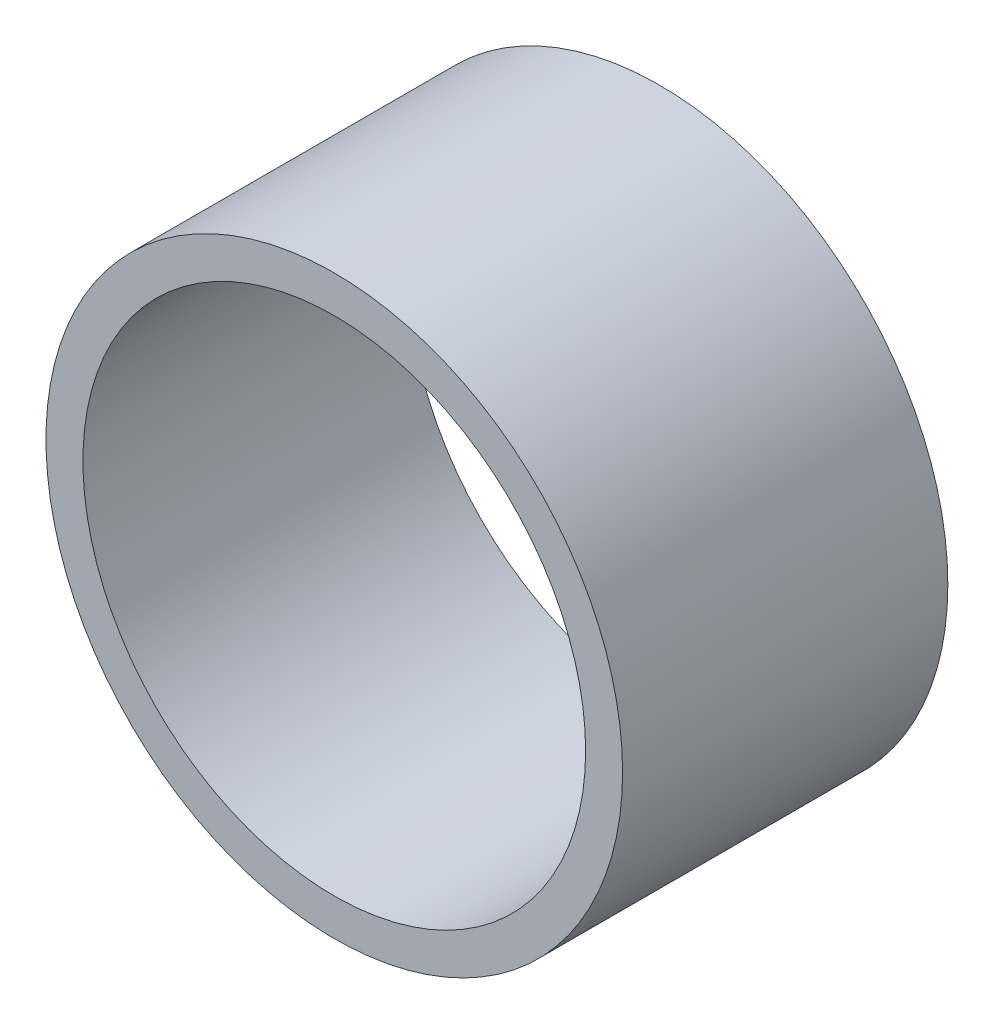
ISO-10303-21;
HEADER;
FILE_DESCRIPTION(('STEP AP214'),'2;1');
FILE_NAME('part.step','',(''),(''),'','','');
FILE_SCHEMA(('AUTOMOTIVE_DESIGN { 1 0 10303 214 1 1 1 1 }'));
ENDSEC;
DATA;
#1=APPLICATION_CONTEXT('core data for automotive mechanical design processes');
#2=APPLICATION_PROTOCOL_DEFINITION('international standard','automotive_design',2000,#1);
#3=PRODUCT_CONTEXT('',#1,'mechanical');
#4=PRODUCT('Part','Part','',(#3));
#5=PRODUCT_RELATED_PRODUCT_CATEGORY('part','',(#4));
#6=PRODUCT_DEFINITION_FORMATION('','',#4);
#7=PRODUCT_DEFINITION_CONTEXT('part definition',#1,'design');
#8=PRODUCT_DEFINITION('design','',#6,#7);
#9=PRODUCT_DEFINITION_SHAPE('','',#8);
#10=(LENGTH_UNIT() NAMED_UNIT(*) SI_UNIT(.MILLI.,.METRE.));
#11=(NAMED_UNIT(*) PLANE_ANGLE_UNIT() SI_UNIT($,.RADIAN.));
#12=(NAMED_UNIT(*) SI_UNIT($,.STERADIAN.) SOLID_ANGLE_UNIT());
#13=UNCERTAINTY_MEASURE_WITH_UNIT(LENGTH_MEASURE(1.E-05),#10,'distance_accuracy_value','');
#14=(GEOMETRIC_REPRESENTATION_CONTEXT(3) GLOBAL_UNCERTAINTY_ASSIGNED_CONTEXT((#13)) GLOBAL_UNIT_ASSIGNED_CONTEXT((#10,
#11,#12)) REPRESENTATION_CONTEXT('',''));
#15=CARTESIAN_POINT('',(0.,0.,0.));
#16=DIRECTION('',(0.,0.,1.));
#17=DIRECTION('',(1.,0.,0.));
#18=AXIS2_PLACEMENT_3D('',#15,#16,#17);
#19=CARTESIAN_POINT('',(0.,0.,11.));
#20=DIRECTION('',(0.,0.,-1.));
#21=DIRECTION('',(-1.,0.,0.));
#22=AXIS2_PLACEMENT_3D('',#19,#20,#21);
#23=CYLINDRICAL_SURFACE('',#22,9.75);
#24=CARTESIAN_POINT('',(0.,0.,11.));
#25=DIRECTION('',(0.,0.,-1.));
#26=DIRECTION('',(1.,0.,0.));
#27=AXIS2_PLACEMENT_3D('',#24,#25,#26);
#28=CIRCLE('',#27,9.75);
#29=CARTESIAN_POINT('',(9.75,0.,11.));
#30=VERTEX_POINT('',#29);
#31=EDGE_CURVE('E22',#30,#30,#28,.T.);
#32=ORIENTED_EDGE('',*,*,#31,.T.);
#33=EDGE_LOOP('',(#32));
#34=FACE_BOUND('',#33,.T.);
#35=CARTESIAN_POINT('',(0.,0.,0.));
#36=DIRECTION('',(0.,0.,-1.));
#37=DIRECTION('',(1.,0.,0.));
#38=AXIS2_PLACEMENT_3D('',#35,#36,#37);
#39=CIRCLE('',#38,9.75);
#40=CARTESIAN_POINT('',(9.75,0.,0.));
#41=VERTEX_POINT('',#40);
#42=EDGE_CURVE('E28',#41,#41,#39,.T.);
#43=ORIENTED_EDGE('',*,*,#42,.F.);
#44=EDGE_LOOP('',(#43));
#45=FACE_BOUND('',#44,.T.);
#46=ADVANCED_FACE('F15',(#34,#45),#23,.T.);
#47=CARTESIAN_POINT('',(0.,0.,11.));
#48=DIRECTION('',(0.,0.,-1.));
#49=DIRECTION('',(-1.,0.,0.));
#50=AXIS2_PLACEMENT_3D('',#47,#48,#49);
#51=CYLINDRICAL_SURFACE('',#50,8.5);
#52=CARTESIAN_POINT('',(0.,0.,11.));
#53=DIRECTION('',(0.,0.,-1.));
#54=DIRECTION('',(1.,0.,0.));
#55=AXIS2_PLACEMENT_3D('',#52,#53,#54);
#56=CIRCLE('',#55,8.5);
#57=CARTESIAN_POINT('',(8.5,0.,11.));
#58=VERTEX_POINT('',#57);
#59=EDGE_CURVE('E10',#58,#58,#56,.T.);
#60=ORIENTED_EDGE('',*,*,#59,.F.);
#61=EDGE_LOOP('',(#60));
#62=FACE_BOUND('',#61,.T.);
#63=CARTESIAN_POINT('',(0.,0.,0.));
#64=DIRECTION('',(0.,0.,-1.));
#65=DIRECTION('',(1.,0.,0.));
#66=AXIS2_PLACEMENT_3D('',#63,#64,#65);
#67=CIRCLE('',#66,8.5);
#68=CARTESIAN_POINT('',(8.5,0.,0.));
#69=VERTEX_POINT('',#68);
#70=EDGE_CURVE('E18',#69,#69,#67,.T.);
#71=ORIENTED_EDGE('',*,*,#70,.T.);
#72=EDGE_LOOP('',(#71));
#73=FACE_BOUND('',#72,.T.);
#74=ADVANCED_FACE('F35',(#62,#73),#51,.F.);
#75=CARTESIAN_POINT('',(0.,0.,11.));
#76=DIRECTION('',(0.,0.,-1.));
#77=DIRECTION('',(-1.,0.,0.));
#78=AXIS2_PLACEMENT_3D('',#75,#76,#77);
#79=PLANE('',#78);
#80=ORIENTED_EDGE('',*,*,#31,.F.);
#81=EDGE_LOOP('',(#80));
#82=FACE_BOUND('',#81,.T.);
#83=ORIENTED_EDGE('',*,*,#59,.T.);
#84=EDGE_LOOP('',(#83));
#85=FACE_BOUND('',#84,.T.);
#86=ADVANCED_FACE('F39',(#82,#85),#79,.F.);
#87=CARTESIAN_POINT('',(0.,0.,0.));
#88=DIRECTION('',(0.,0.,-1.));
#89=DIRECTION('',(-1.,0.,0.));
#90=AXIS2_PLACEMENT_3D('',#87,#88,#89);
#91=PLANE('',#90);
#92=ORIENTED_EDGE('',*,*,#42,.T.);
#93=EDGE_LOOP('',(#92));
#94=FACE_BOUND('',#93,.T.);
#95=ORIENTED_EDGE('',*,*,#70,.F.);
#96=EDGE_LOOP('',(#95));
#97=FACE_BOUND('',#96,.T.);
#98=ADVANCED_FACE('F37',(#94,#97),#91,.T.);
#99=CLOSED_SHELL('',(#46,#74,#86,#98));
#100=MANIFOLD_SOLID_BREP('B1',#99);
#101=ADVANCED_BREP_SHAPE_REPRESENTATION('',(#18,#100),#14);
#102=SHAPE_DEFINITION_REPRESENTATION(#9,#101);
ENDSEC;
END-ISO-10303-21;
